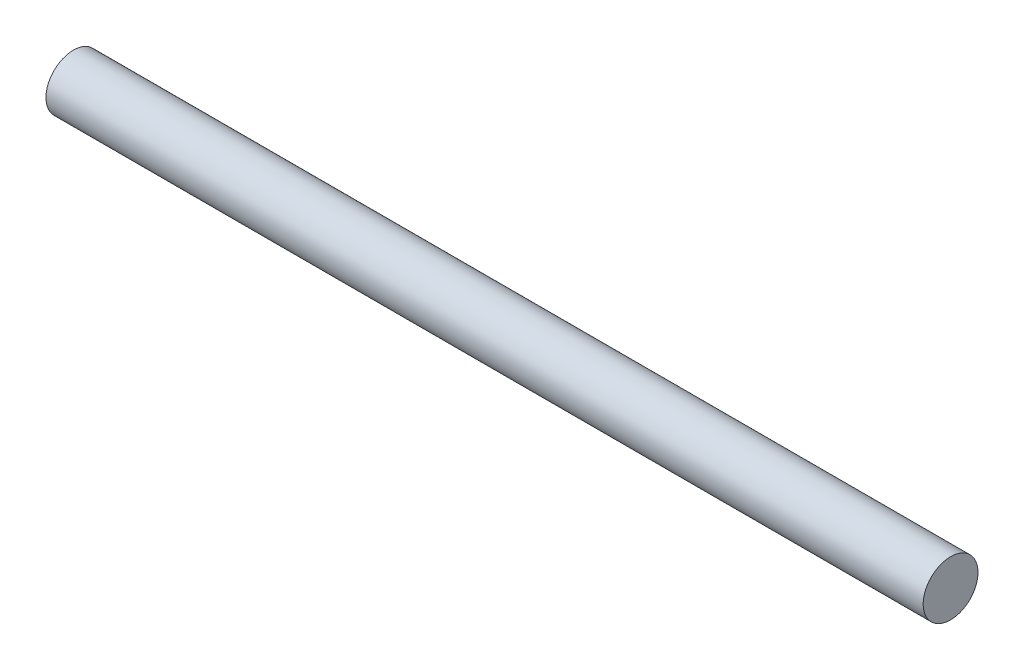
ISO-10303-21;
HEADER;
FILE_DESCRIPTION(('STEP AP214'),'2;1');
FILE_NAME('part.step','',(''),(''),'','','');
FILE_SCHEMA(('AUTOMOTIVE_DESIGN { 1 0 10303 214 1 1 1 1 }'));
ENDSEC;
DATA;
#1=APPLICATION_CONTEXT('core data for automotive mechanical design processes');
#2=APPLICATION_PROTOCOL_DEFINITION('international standard','automotive_design',2000,#1);
#3=PRODUCT_CONTEXT('',#1,'mechanical');
#4=PRODUCT('Part','Part','',(#3));
#5=PRODUCT_RELATED_PRODUCT_CATEGORY('part','',(#4));
#6=PRODUCT_DEFINITION_FORMATION('','',#4);
#7=PRODUCT_DEFINITION_CONTEXT('part definition',#1,'design');
#8=PRODUCT_DEFINITION('design','',#6,#7);
#9=PRODUCT_DEFINITION_SHAPE('','',#8);
#10=(LENGTH_UNIT() NAMED_UNIT(*) SI_UNIT(.MILLI.,.METRE.));
#11=(NAMED_UNIT(*) PLANE_ANGLE_UNIT() SI_UNIT($,.RADIAN.));
#12=(NAMED_UNIT(*) SI_UNIT($,.STERADIAN.) SOLID_ANGLE_UNIT());
#13=UNCERTAINTY_MEASURE_WITH_UNIT(LENGTH_MEASURE(1.E-05),#10,'distance_accuracy_value','');
#14=(GEOMETRIC_REPRESENTATION_CONTEXT(3) GLOBAL_UNCERTAINTY_ASSIGNED_CONTEXT((#13)) GLOBAL_UNIT_ASSIGNED_CONTEXT((#10,
#11,#12)) REPRESENTATION_CONTEXT('',''));
#15=CARTESIAN_POINT('',(0.,0.,0.));
#16=DIRECTION('',(0.,0.,1.));
#17=DIRECTION('',(1.,0.,0.));
#18=AXIS2_PLACEMENT_3D('',#15,#16,#17);
#19=CARTESIAN_POINT('',(80.,0.,0.));
#20=DIRECTION('',(-1.,0.,0.));
#21=DIRECTION('',(0.,0.,1.));
#22=AXIS2_PLACEMENT_3D('',#19,#20,#21);
#23=CYLINDRICAL_SURFACE('',#22,2.5);
#24=CARTESIAN_POINT('',(80.,0.,0.));
#25=DIRECTION('',(1.,0.,0.));
#26=DIRECTION('',(0.,0.,-1.));
#27=AXIS2_PLACEMENT_3D('',#24,#25,#26);
#28=CIRCLE('',#27,2.5);
#29=CARTESIAN_POINT('',(80.,0.,-2.5));
#30=VERTEX_POINT('',#29);
#31=EDGE_CURVE('E10',#30,#30,#28,.T.);
#32=ORIENTED_EDGE('',*,*,#31,.F.);
#33=EDGE_LOOP('',(#32));
#34=FACE_BOUND('',#33,.T.);
#35=CARTESIAN_POINT('',(0.,0.,0.));
#36=DIRECTION('',(1.,0.,0.));
#37=DIRECTION('',(0.,0.,-1.));
#38=AXIS2_PLACEMENT_3D('',#35,#36,#37);
#39=CIRCLE('',#38,2.5);
#40=CARTESIAN_POINT('',(0.,0.,-2.5));
#41=VERTEX_POINT('',#40);
#42=EDGE_CURVE('E34',#41,#41,#39,.T.);
#43=ORIENTED_EDGE('',*,*,#42,.T.);
#44=EDGE_LOOP('',(#43));
#45=FACE_BOUND('',#44,.T.);
#46=ADVANCED_FACE('F31',(#34,#45),#23,.T.);
#47=CARTESIAN_POINT('',(80.,0.,0.));
#48=DIRECTION('',(1.,0.,0.));
#49=DIRECTION('',(0.,0.,-1.));
#50=AXIS2_PLACEMENT_3D('',#47,#48,#49);
#51=PLANE('',#50);
#52=ORIENTED_EDGE('',*,*,#31,.T.);
#53=EDGE_LOOP('',(#52));
#54=FACE_BOUND('',#53,.T.);
#55=ADVANCED_FACE('F46',(#54),#51,.T.);
#56=CARTESIAN_POINT('',(0.,0.,0.));
#57=DIRECTION('',(1.,0.,0.));
#58=DIRECTION('',(0.,0.,-1.));
#59=AXIS2_PLACEMENT_3D('',#56,#57,#58);
#60=PLANE('',#59);
#61=ORIENTED_EDGE('',*,*,#42,.F.);
#62=EDGE_LOOP('',(#61));
#63=FACE_BOUND('',#62,.T.);
#64=ADVANCED_FACE('F44',(#63),#60,.F.);
#65=CLOSED_SHELL('',(#46,#55,#64));
#66=MANIFOLD_SOLID_BREP('B2',#65);
#67=ADVANCED_BREP_SHAPE_REPRESENTATION('',(#18,#66),#14);
#68=SHAPE_DEFINITION_REPRESENTATION(#9,#67);
ENDSEC;
END-ISO-10303-21;
